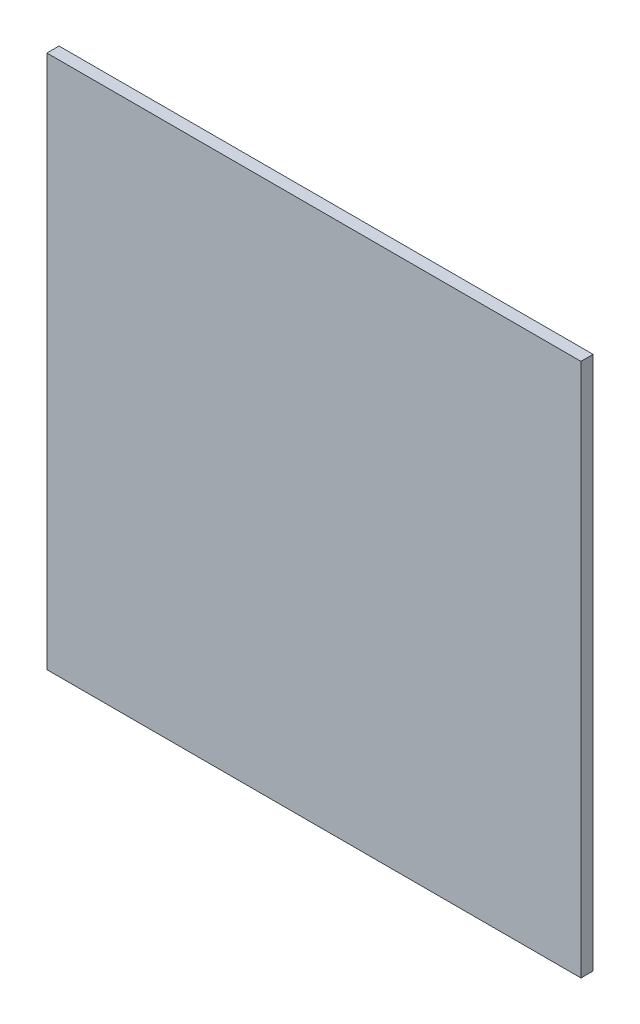
ISO-10303-21;
HEADER;
FILE_DESCRIPTION(('STEP AP214'),'2;1');
FILE_NAME('part.step','',(''),(''),'','','');
FILE_SCHEMA(('AUTOMOTIVE_DESIGN { 1 0 10303 214 1 1 1 1 }'));
ENDSEC;
DATA;
#1=APPLICATION_CONTEXT('core data for automotive mechanical design processes');
#2=APPLICATION_PROTOCOL_DEFINITION('international standard','automotive_design',2000,#1);
#3=PRODUCT_CONTEXT('',#1,'mechanical');
#4=PRODUCT('Part','Part','',(#3));
#5=PRODUCT_RELATED_PRODUCT_CATEGORY('part','',(#4));
#6=PRODUCT_DEFINITION_FORMATION('','',#4);
#7=PRODUCT_DEFINITION_CONTEXT('part definition',#1,'design');
#8=PRODUCT_DEFINITION('design','',#6,#7);
#9=PRODUCT_DEFINITION_SHAPE('','',#8);
#10=(LENGTH_UNIT() NAMED_UNIT(*) SI_UNIT(.MILLI.,.METRE.));
#11=(NAMED_UNIT(*) PLANE_ANGLE_UNIT() SI_UNIT($,.RADIAN.));
#12=(NAMED_UNIT(*) SI_UNIT($,.STERADIAN.) SOLID_ANGLE_UNIT());
#13=UNCERTAINTY_MEASURE_WITH_UNIT(LENGTH_MEASURE(1.E-05),#10,'distance_accuracy_value','');
#14=(GEOMETRIC_REPRESENTATION_CONTEXT(3) GLOBAL_UNCERTAINTY_ASSIGNED_CONTEXT((#13)) GLOBAL_UNIT_ASSIGNED_CONTEXT((#10,
#11,#12)) REPRESENTATION_CONTEXT('',''));
#15=CARTESIAN_POINT('',(0.,0.,0.));
#16=DIRECTION('',(0.,0.,1.));
#17=DIRECTION('',(1.,0.,0.));
#18=AXIS2_PLACEMENT_3D('',#15,#16,#17);
#19=CARTESIAN_POINT('',(-68.2625,142.875,3.175));
#20=DIRECTION('',(1.,0.,0.));
#21=DIRECTION('',(0.,0.,-1.));
#22=AXIS2_PLACEMENT_3D('',#19,#20,#21);
#23=PLANE('',#22);
#24=DIRECTION('',(0.,-1.,0.));
#25=VECTOR('',#24,1.);
#26=CARTESIAN_POINT('',(-68.2625,142.875,0.));
#27=LINE('',#26,#25);
#28=CARTESIAN_POINT('',(-68.2625,142.875,0.));
#29=VERTEX_POINT('',#28);
#30=CARTESIAN_POINT('',(-68.2625,3.17499999999997,0.));
#31=VERTEX_POINT('',#30);
#32=EDGE_CURVE('E95',#29,#31,#27,.T.);
#33=ORIENTED_EDGE('',*,*,#32,.T.);
#34=DIRECTION('',(0.,0.,-1.));
#35=VECTOR('',#34,1.);
#36=CARTESIAN_POINT('',(-68.2625,3.17499999999997,3.175));
#37=LINE('',#36,#35);
#38=CARTESIAN_POINT('',(-68.2625,3.17499999999997,3.175));
#39=VERTEX_POINT('',#38);
#40=EDGE_CURVE('E11',#39,#31,#37,.T.);
#41=ORIENTED_EDGE('',*,*,#40,.F.);
#42=DIRECTION('',(0.,-1.,0.));
#43=VECTOR('',#42,1.);
#44=CARTESIAN_POINT('',(-68.2625,142.875,3.175));
#45=LINE('',#44,#43);
#46=CARTESIAN_POINT('',(-68.2625,142.875,3.175));
#47=VERTEX_POINT('',#46);
#48=EDGE_CURVE('E81',#47,#39,#45,.T.);
#49=ORIENTED_EDGE('',*,*,#48,.F.);
#50=DIRECTION('',(0.,0.,-1.));
#51=VECTOR('',#50,1.);
#52=CARTESIAN_POINT('',(-68.2625,142.875,3.175));
#53=LINE('',#52,#51);
#54=EDGE_CURVE('E48',#47,#29,#53,.T.);
#55=ORIENTED_EDGE('',*,*,#54,.T.);
#56=EDGE_LOOP('',(#33,#41,#49,#55));
#57=FACE_BOUND('',#56,.T.);
#58=ADVANCED_FACE('F32',(#57),#23,.F.);
#59=CARTESIAN_POINT('',(-68.2625,3.17499999999997,3.175));
#60=DIRECTION('',(0.,1.,0.));
#61=DIRECTION('',(0.,0.,1.));
#62=AXIS2_PLACEMENT_3D('',#59,#60,#61);
#63=PLANE('',#62);
#64=DIRECTION('',(1.,0.,0.));
#65=VECTOR('',#64,1.);
#66=CARTESIAN_POINT('',(-68.2625,3.17499999999997,0.));
#67=LINE('',#66,#65);
#68=CARTESIAN_POINT('',(71.4374999999999,3.17499999999997,0.));
#69=VERTEX_POINT('',#68);
#70=EDGE_CURVE('E86',#31,#69,#67,.T.);
#71=ORIENTED_EDGE('',*,*,#70,.T.);
#72=DIRECTION('',(0.,0.,-1.));
#73=VECTOR('',#72,1.);
#74=CARTESIAN_POINT('',(71.4374999999999,3.17499999999997,3.175));
#75=LINE('',#74,#73);
#76=CARTESIAN_POINT('',(71.4374999999999,3.17499999999997,3.175));
#77=VERTEX_POINT('',#76);
#78=EDGE_CURVE('E40',#77,#69,#75,.T.);
#79=ORIENTED_EDGE('',*,*,#78,.F.);
#80=DIRECTION('',(1.,0.,0.));
#81=VECTOR('',#80,1.);
#82=CARTESIAN_POINT('',(-68.2625,3.17499999999997,3.175));
#83=LINE('',#82,#81);
#84=EDGE_CURVE('E73',#39,#77,#83,.T.);
#85=ORIENTED_EDGE('',*,*,#84,.F.);
#86=ORIENTED_EDGE('',*,*,#40,.T.);
#87=EDGE_LOOP('',(#71,#79,#85,#86));
#88=FACE_BOUND('',#87,.T.);
#89=ADVANCED_FACE('F85',(#88),#63,.F.);
#90=CARTESIAN_POINT('',(71.4374999999999,142.875,3.175));
#91=DIRECTION('',(1.,0.,0.));
#92=DIRECTION('',(0.,0.,-1.));
#93=AXIS2_PLACEMENT_3D('',#90,#91,#92);
#94=PLANE('',#93);
#95=DIRECTION('',(0.,-1.,0.));
#96=VECTOR('',#95,1.);
#97=CARTESIAN_POINT('',(71.4374999999999,142.875,0.));
#98=LINE('',#97,#96);
#99=CARTESIAN_POINT('',(71.4374999999999,142.875,0.));
#100=VERTEX_POINT('',#99);
#101=EDGE_CURVE('E98',#100,#69,#98,.T.);
#102=ORIENTED_EDGE('',*,*,#101,.F.);
#103=DIRECTION('',(0.,0.,-1.));
#104=VECTOR('',#103,1.);
#105=CARTESIAN_POINT('',(71.4374999999999,142.875,3.175));
#106=LINE('',#105,#104);
#107=CARTESIAN_POINT('',(71.4374999999999,142.875,3.175));
#108=VERTEX_POINT('',#107);
#109=EDGE_CURVE('E62',#108,#100,#106,.T.);
#110=ORIENTED_EDGE('',*,*,#109,.F.);
#111=DIRECTION('',(0.,-1.,0.));
#112=VECTOR('',#111,1.);
#113=CARTESIAN_POINT('',(71.4374999999999,142.875,3.175));
#114=LINE('',#113,#112);
#115=EDGE_CURVE('E80',#108,#77,#114,.T.);
#116=ORIENTED_EDGE('',*,*,#115,.T.);
#117=ORIENTED_EDGE('',*,*,#78,.T.);
#118=EDGE_LOOP('',(#102,#110,#116,#117));
#119=FACE_BOUND('',#118,.T.);
#120=ADVANCED_FACE('F89',(#119),#94,.T.);
#121=CARTESIAN_POINT('',(-68.2625,142.875,3.175));
#122=DIRECTION('',(0.,1.,0.));
#123=DIRECTION('',(0.,0.,1.));
#124=AXIS2_PLACEMENT_3D('',#121,#122,#123);
#125=PLANE('',#124);
#126=DIRECTION('',(1.,0.,0.));
#127=VECTOR('',#126,1.);
#128=CARTESIAN_POINT('',(-68.2625,142.875,0.));
#129=LINE('',#128,#127);
#130=EDGE_CURVE('E100',#29,#100,#129,.T.);
#131=ORIENTED_EDGE('',*,*,#130,.F.);
#132=ORIENTED_EDGE('',*,*,#54,.F.);
#133=DIRECTION('',(1.,0.,0.));
#134=VECTOR('',#133,1.);
#135=CARTESIAN_POINT('',(-68.2625,142.875,3.175));
#136=LINE('',#135,#134);
#137=EDGE_CURVE('E90',#47,#108,#136,.T.);
#138=ORIENTED_EDGE('',*,*,#137,.T.);
#139=ORIENTED_EDGE('',*,*,#109,.T.);
#140=EDGE_LOOP('',(#131,#132,#138,#139));
#141=FACE_BOUND('',#140,.T.);
#142=ADVANCED_FACE('F106',(#141),#125,.T.);
#143=CARTESIAN_POINT('',(0.,0.,3.175));
#144=DIRECTION('',(0.,0.,1.));
#145=DIRECTION('',(1.,0.,0.));
#146=AXIS2_PLACEMENT_3D('',#143,#144,#145);
#147=PLANE('',#146);
#148=ORIENTED_EDGE('',*,*,#48,.T.);
#149=ORIENTED_EDGE('',*,*,#84,.T.);
#150=ORIENTED_EDGE('',*,*,#115,.F.);
#151=ORIENTED_EDGE('',*,*,#137,.F.);
#152=EDGE_LOOP('',(#148,#149,#150,#151));
#153=FACE_BOUND('',#152,.T.);
#154=ADVANCED_FACE('F77',(#153),#147,.T.);
#155=CARTESIAN_POINT('',(0.,0.,0.));
#156=DIRECTION('',(0.,0.,1.));
#157=DIRECTION('',(1.,0.,0.));
#158=AXIS2_PLACEMENT_3D('',#155,#156,#157);
#159=PLANE('',#158);
#160=ORIENTED_EDGE('',*,*,#32,.F.);
#161=ORIENTED_EDGE('',*,*,#130,.T.);
#162=ORIENTED_EDGE('',*,*,#101,.T.);
#163=ORIENTED_EDGE('',*,*,#70,.F.);
#164=EDGE_LOOP('',(#160,#161,#162,#163));
#165=FACE_BOUND('',#164,.T.);
#166=ADVANCED_FACE('F105',(#165),#159,.F.);
#167=CLOSED_SHELL('',(#58,#89,#120,#142,#154,#166));
#168=MANIFOLD_SOLID_BREP('B2',#167);
#169=ADVANCED_BREP_SHAPE_REPRESENTATION('',(#18,#168),#14);
#170=SHAPE_DEFINITION_REPRESENTATION(#9,#169);
ENDSEC;
END-ISO-10303-21;
